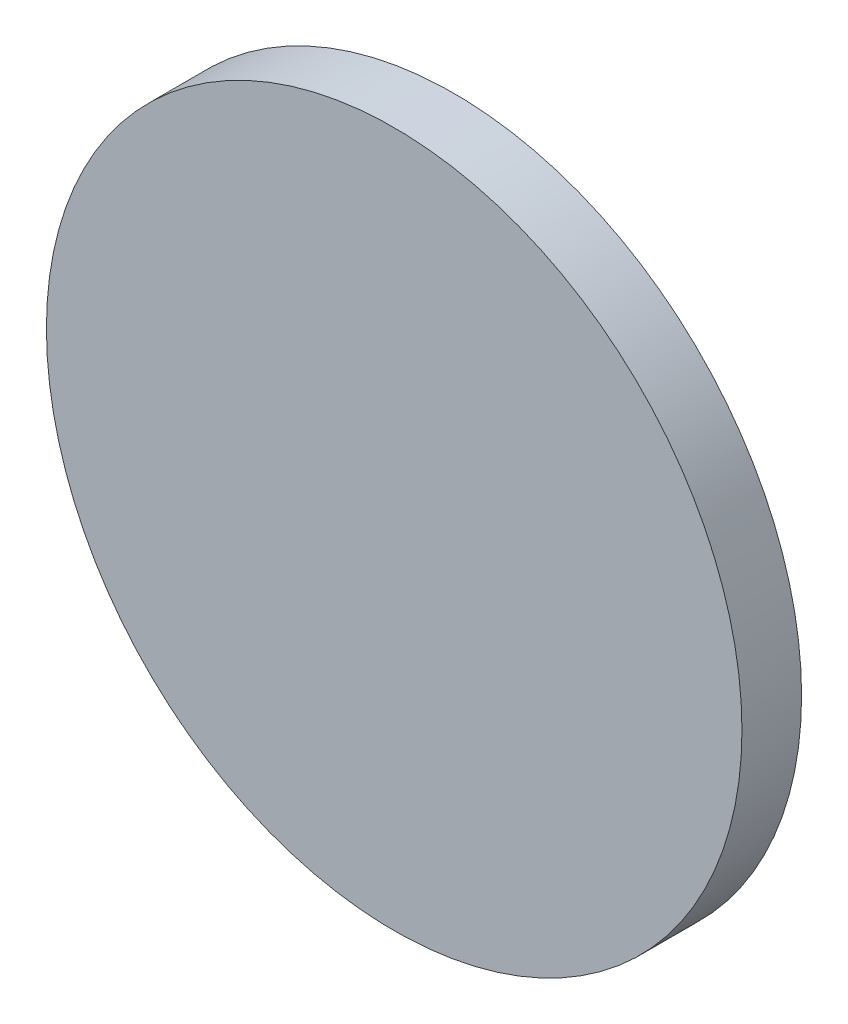
ISO-10303-21;
HEADER;
FILE_DESCRIPTION(('STEP AP214'),'2;1');
FILE_NAME('part.step','',(''),(''),'','','');
FILE_SCHEMA(('AUTOMOTIVE_DESIGN { 1 0 10303 214 1 1 1 1 }'));
ENDSEC;
DATA;
#1=APPLICATION_CONTEXT('core data for automotive mechanical design processes');
#2=APPLICATION_PROTOCOL_DEFINITION('international standard','automotive_design',2000,#1);
#3=PRODUCT_CONTEXT('',#1,'mechanical');
#4=PRODUCT('Part','Part','',(#3));
#5=PRODUCT_RELATED_PRODUCT_CATEGORY('part','',(#4));
#6=PRODUCT_DEFINITION_FORMATION('','',#4);
#7=PRODUCT_DEFINITION_CONTEXT('part definition',#1,'design');
#8=PRODUCT_DEFINITION('design','',#6,#7);
#9=PRODUCT_DEFINITION_SHAPE('','',#8);
#10=(LENGTH_UNIT() NAMED_UNIT(*) SI_UNIT(.MILLI.,.METRE.));
#11=(NAMED_UNIT(*) PLANE_ANGLE_UNIT() SI_UNIT($,.RADIAN.));
#12=(NAMED_UNIT(*) SI_UNIT($,.STERADIAN.) SOLID_ANGLE_UNIT());
#13=UNCERTAINTY_MEASURE_WITH_UNIT(LENGTH_MEASURE(1.E-05),#10,'distance_accuracy_value','');
#14=(GEOMETRIC_REPRESENTATION_CONTEXT(3) GLOBAL_UNCERTAINTY_ASSIGNED_CONTEXT((#13)) GLOBAL_UNIT_ASSIGNED_CONTEXT((#10,
#11,#12)) REPRESENTATION_CONTEXT('',''));
#15=CARTESIAN_POINT('',(0.,0.,0.));
#16=DIRECTION('',(0.,0.,1.));
#17=DIRECTION('',(1.,0.,0.));
#18=AXIS2_PLACEMENT_3D('',#15,#16,#17);
#19=CARTESIAN_POINT('',(4.60008,10.9,0.76487));
#20=DIRECTION('',(0.,0.,-1.));
#21=DIRECTION('',(-1.,0.,0.));
#22=AXIS2_PLACEMENT_3D('',#19,#20,#21);
#23=PLANE('',#22);
#24=CARTESIAN_POINT('',(4.60008,10.9,0.76487));
#25=DIRECTION('',(0.,0.,1.));
#26=DIRECTION('',(1.,0.,0.));
#27=AXIS2_PLACEMENT_3D('',#24,#25,#26);
#28=CIRCLE('',#27,0.200024667);
#29=CARTESIAN_POINT('',(4.800104667,10.9,0.76487));
#30=VERTEX_POINT('',#29);
#31=EDGE_CURVE('E18',#30,#30,#28,.T.);
#32=ORIENTED_EDGE('',*,*,#31,.F.);
#33=EDGE_LOOP('',(#32));
#34=FACE_BOUND('',#33,.T.);
#35=ADVANCED_FACE('F15',(#34),#23,.T.);
#36=CARTESIAN_POINT('',(4.60008,10.9,0.76487));
#37=DIRECTION('',(0.,0.,1.));
#38=DIRECTION('',(1.,0.,0.));
#39=AXIS2_PLACEMENT_3D('',#36,#37,#38);
#40=CYLINDRICAL_SURFACE('',#39,0.200024667);
#41=CARTESIAN_POINT('',(4.60008,10.9,0.79916));
#42=DIRECTION('',(0.,0.,1.));
#43=DIRECTION('',(1.,0.,0.));
#44=AXIS2_PLACEMENT_3D('',#41,#42,#43);
#45=CIRCLE('',#44,0.200024667);
#46=CARTESIAN_POINT('',(4.800104667,10.9,0.79916));
#47=VERTEX_POINT('',#46);
#48=EDGE_CURVE('E10',#47,#47,#45,.T.);
#49=ORIENTED_EDGE('',*,*,#48,.F.);
#50=EDGE_LOOP('',(#49));
#51=FACE_BOUND('',#50,.T.);
#52=ORIENTED_EDGE('',*,*,#31,.T.);
#53=EDGE_LOOP('',(#52));
#54=FACE_BOUND('',#53,.T.);
#55=ADVANCED_FACE('F27',(#51,#54),#40,.T.);
#56=CARTESIAN_POINT('',(4.60008,10.9,0.79916));
#57=DIRECTION('',(0.,0.,1.));
#58=DIRECTION('',(1.,0.,0.));
#59=AXIS2_PLACEMENT_3D('',#56,#57,#58);
#60=PLANE('',#59);
#61=ORIENTED_EDGE('',*,*,#48,.T.);
#62=EDGE_LOOP('',(#61));
#63=FACE_BOUND('',#62,.T.);
#64=ADVANCED_FACE('F34',(#63),#60,.T.);
#65=CLOSED_SHELL('',(#35,#55,#64));
#66=MANIFOLD_SOLID_BREP('B1',#65);
#67=ADVANCED_BREP_SHAPE_REPRESENTATION('',(#18,#66),#14);
#68=SHAPE_DEFINITION_REPRESENTATION(#9,#67);
ENDSEC;
END-ISO-10303-21;
